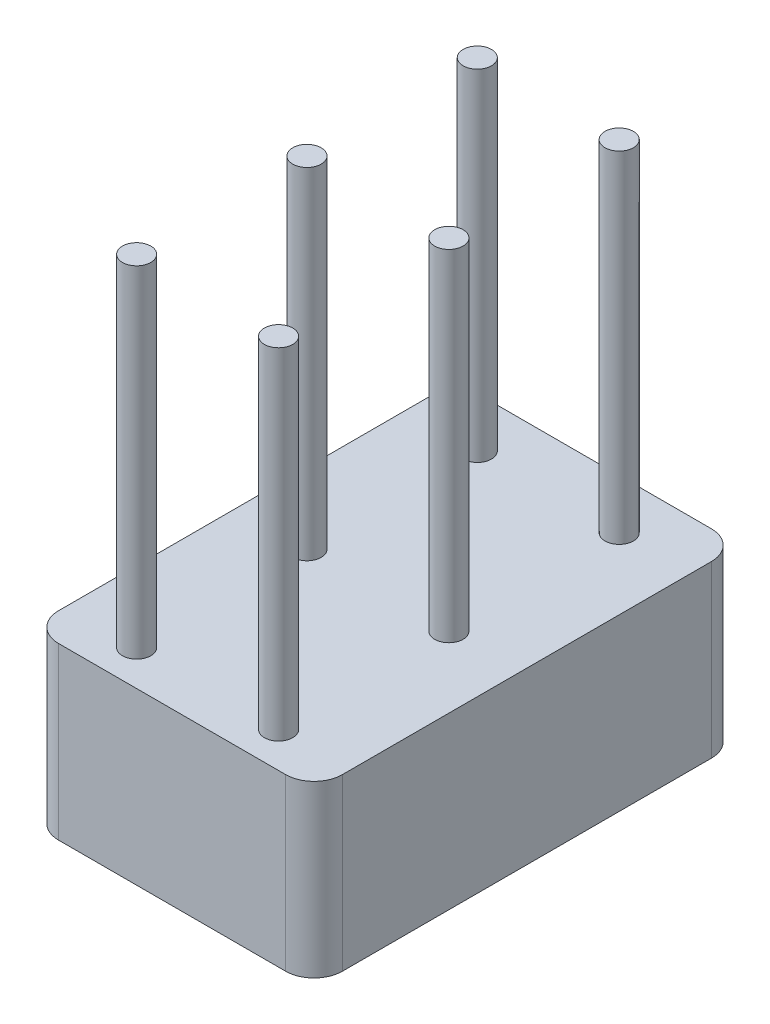
ISO-10303-21;
HEADER;
FILE_DESCRIPTION(('STEP AP214'),'2;1');
FILE_NAME('part.step','',(''),(''),'','','');
FILE_SCHEMA(('AUTOMOTIVE_DESIGN { 1 0 10303 214 1 1 1 1 }'));
ENDSEC;
DATA;
#1=APPLICATION_CONTEXT('core data for automotive mechanical design processes');
#2=APPLICATION_PROTOCOL_DEFINITION('international standard','automotive_design',2000,#1);
#3=PRODUCT_CONTEXT('',#1,'mechanical');
#4=PRODUCT('Part','Part','',(#3));
#5=PRODUCT_RELATED_PRODUCT_CATEGORY('part','',(#4));
#6=PRODUCT_DEFINITION_FORMATION('','',#4);
#7=PRODUCT_DEFINITION_CONTEXT('part definition',#1,'design');
#8=PRODUCT_DEFINITION('design','',#6,#7);
#9=PRODUCT_DEFINITION_SHAPE('','',#8);
#10=(LENGTH_UNIT() NAMED_UNIT(*) SI_UNIT(.MILLI.,.METRE.));
#11=(NAMED_UNIT(*) PLANE_ANGLE_UNIT() SI_UNIT($,.RADIAN.));
#12=(NAMED_UNIT(*) SI_UNIT($,.STERADIAN.) SOLID_ANGLE_UNIT());
#13=UNCERTAINTY_MEASURE_WITH_UNIT(LENGTH_MEASURE(1.E-05),#10,'distance_accuracy_value','');
#14=(GEOMETRIC_REPRESENTATION_CONTEXT(3) GLOBAL_UNCERTAINTY_ASSIGNED_CONTEXT((#13)) GLOBAL_UNIT_ASSIGNED_CONTEXT((#10,
#11,#12)) REPRESENTATION_CONTEXT('',''));
#15=CARTESIAN_POINT('',(0.,0.,0.));
#16=DIRECTION('',(0.,0.,1.));
#17=DIRECTION('',(1.,0.,0.));
#18=AXIS2_PLACEMENT_3D('',#15,#16,#17);
#19=CARTESIAN_POINT('',(2.,3.,-3.25));
#20=DIRECTION('',(0.,1.,0.));
#21=DIRECTION('',(0.,0.,1.));
#22=AXIS2_PLACEMENT_3D('',#19,#20,#21);
#23=PLANE('',#22);
#24=CARTESIAN_POINT('',(-1.24999999999994,3.,3.12455171858));
#25=DIRECTION('',(0.,1.,0.));
#26=DIRECTION('',(0.,0.,1.));
#27=AXIS2_PLACEMENT_3D('',#24,#25,#26);
#28=CIRCLE('',#27,0.25);
#29=CARTESIAN_POINT('',(-1.24999999999994,3.,3.37455171858));
#30=VERTEX_POINT('',#29);
#31=EDGE_CURVE('E204',#30,#30,#28,.T.);
#32=ORIENTED_EDGE('',*,*,#31,.F.);
#33=EDGE_LOOP('',(#32));
#34=FACE_BOUND('',#33,.T.);
#35=CARTESIAN_POINT('',(-1.24999999999997,3.,0.124551718579996));
#36=DIRECTION('',(0.,1.,0.));
#37=DIRECTION('',(0.,0.,1.));
#38=AXIS2_PLACEMENT_3D('',#35,#36,#37);
#39=CIRCLE('',#38,0.25);
#40=CARTESIAN_POINT('',(-1.24999999999997,3.,0.374551718579996));
#41=VERTEX_POINT('',#40);
#42=EDGE_CURVE('E192',#41,#41,#39,.T.);
#43=ORIENTED_EDGE('',*,*,#42,.F.);
#44=EDGE_LOOP('',(#43));
#45=FACE_BOUND('',#44,.T.);
#46=CARTESIAN_POINT('',(-1.25,3.,-2.87544828142));
#47=DIRECTION('',(0.,1.,0.));
#48=DIRECTION('',(0.,0.,1.));
#49=AXIS2_PLACEMENT_3D('',#46,#47,#48);
#50=CIRCLE('',#49,0.25);
#51=CARTESIAN_POINT('',(-1.25,3.,-2.62544828142));
#52=VERTEX_POINT('',#51);
#53=EDGE_CURVE('E180',#52,#52,#50,.T.);
#54=ORIENTED_EDGE('',*,*,#53,.F.);
#55=EDGE_LOOP('',(#54));
#56=FACE_BOUND('',#55,.T.);
#57=CARTESIAN_POINT('',(2.,3.,-3.25));
#58=DIRECTION('',(0.,1.,0.));
#59=DIRECTION('',(0.,0.,1.));
#60=AXIS2_PLACEMENT_3D('',#57,#58,#59);
#61=CIRCLE('',#60,0.5);
#62=CARTESIAN_POINT('',(2.5,3.,-3.25));
#63=VERTEX_POINT('',#62);
#64=CARTESIAN_POINT('',(2.,3.,-3.75));
#65=VERTEX_POINT('',#64);
#66=EDGE_CURVE('E147',#63,#65,#61,.T.);
#67=ORIENTED_EDGE('',*,*,#66,.T.);
#68=DIRECTION('',(-1.,0.,0.));
#69=VECTOR('',#68,1.);
#70=CARTESIAN_POINT('',(-2.,3.,-3.75));
#71=LINE('',#70,#69);
#72=CARTESIAN_POINT('',(-2.,3.,-3.75));
#73=VERTEX_POINT('',#72);
#74=EDGE_CURVE('E95',#65,#73,#71,.T.);
#75=ORIENTED_EDGE('',*,*,#74,.T.);
#76=CARTESIAN_POINT('',(-2.,3.,-3.25));
#77=DIRECTION('',(0.,1.,0.));
#78=DIRECTION('',(0.,0.,1.));
#79=AXIS2_PLACEMENT_3D('',#76,#77,#78);
#80=CIRCLE('',#79,0.5);
#81=CARTESIAN_POINT('',(-2.5,3.,-3.25));
#82=VERTEX_POINT('',#81);
#83=EDGE_CURVE('E162',#73,#82,#80,.T.);
#84=ORIENTED_EDGE('',*,*,#83,.T.);
#85=DIRECTION('',(0.,0.,1.));
#86=VECTOR('',#85,1.);
#87=CARTESIAN_POINT('',(-2.5,3.,-3.25));
#88=LINE('',#87,#86);
#89=CARTESIAN_POINT('',(-2.5,3.,3.25));
#90=VERTEX_POINT('',#89);
#91=EDGE_CURVE('E174',#82,#90,#88,.T.);
#92=ORIENTED_EDGE('',*,*,#91,.T.);
#93=CARTESIAN_POINT('',(-2.,3.,3.25));
#94=DIRECTION('',(0.,1.,0.));
#95=DIRECTION('',(0.,0.,-1.));
#96=AXIS2_PLACEMENT_3D('',#93,#94,#95);
#97=CIRCLE('',#96,0.5);
#98=CARTESIAN_POINT('',(-2.,3.,3.75));
#99=VERTEX_POINT('',#98);
#100=EDGE_CURVE('E114',#90,#99,#97,.T.);
#101=ORIENTED_EDGE('',*,*,#100,.T.);
#102=DIRECTION('',(1.,0.,0.));
#103=VECTOR('',#102,1.);
#104=CARTESIAN_POINT('',(-2.,3.,3.75));
#105=LINE('',#104,#103);
#106=CARTESIAN_POINT('',(2.,3.,3.75));
#107=VERTEX_POINT('',#106);
#108=EDGE_CURVE('E108',#99,#107,#105,.T.);
#109=ORIENTED_EDGE('',*,*,#108,.T.);
#110=CARTESIAN_POINT('',(2.,3.,3.25));
#111=DIRECTION('',(0.,1.,0.));
#112=DIRECTION('',(0.,0.,-1.));
#113=AXIS2_PLACEMENT_3D('',#110,#111,#112);
#114=CIRCLE('',#113,0.5);
#115=CARTESIAN_POINT('',(2.5,3.,3.25));
#116=VERTEX_POINT('',#115);
#117=EDGE_CURVE('E112',#107,#116,#114,.T.);
#118=ORIENTED_EDGE('',*,*,#117,.T.);
#119=DIRECTION('',(0.,0.,-1.));
#120=VECTOR('',#119,1.);
#121=CARTESIAN_POINT('',(2.5,3.,-3.25));
#122=LINE('',#121,#120);
#123=EDGE_CURVE('E52',#116,#63,#122,.T.);
#124=ORIENTED_EDGE('',*,*,#123,.T.);
#125=EDGE_LOOP('',(#67,#75,#84,#92,#101,#109,#118,#124));
#126=FACE_BOUND('',#125,.T.);
#127=CARTESIAN_POINT('',(1.25,3.,-2.87544828142));
#128=DIRECTION('',(0.,1.,0.));
#129=DIRECTION('',(0.,0.,-1.));
#130=AXIS2_PLACEMENT_3D('',#127,#128,#129);
#131=CIRCLE('',#130,0.25);
#132=CARTESIAN_POINT('',(1.25,3.,-3.12544828142));
#133=VERTEX_POINT('',#132);
#134=EDGE_CURVE('E186',#133,#133,#131,.T.);
#135=ORIENTED_EDGE('',*,*,#134,.F.);
#136=EDGE_LOOP('',(#135));
#137=FACE_BOUND('',#136,.T.);
#138=CARTESIAN_POINT('',(1.25000000000003,3.,0.124551718579996));
#139=DIRECTION('',(0.,1.,0.));
#140=DIRECTION('',(0.,0.,-1.));
#141=AXIS2_PLACEMENT_3D('',#138,#139,#140);
#142=CIRCLE('',#141,0.25);
#143=CARTESIAN_POINT('',(1.25000000000003,3.,-0.125448281420004));
#144=VERTEX_POINT('',#143);
#145=EDGE_CURVE('E198',#144,#144,#142,.T.);
#146=ORIENTED_EDGE('',*,*,#145,.F.);
#147=EDGE_LOOP('',(#146));
#148=FACE_BOUND('',#147,.T.);
#149=CARTESIAN_POINT('',(1.25000000000006,3.,3.12455171858));
#150=DIRECTION('',(0.,1.,0.));
#151=DIRECTION('',(0.,0.,-1.));
#152=AXIS2_PLACEMENT_3D('',#149,#150,#151);
#153=CIRCLE('',#152,0.25);
#154=CARTESIAN_POINT('',(1.25000000000006,3.,2.87455171858));
#155=VERTEX_POINT('',#154);
#156=EDGE_CURVE('E210',#155,#155,#153,.T.);
#157=ORIENTED_EDGE('',*,*,#156,.F.);
#158=EDGE_LOOP('',(#157));
#159=FACE_BOUND('',#158,.T.);
#160=ADVANCED_FACE('F35',(#34,#45,#56,#126,#137,#148,#159),#23,.T.);
#161=CARTESIAN_POINT('',(2.,3.,-3.25));
#162=DIRECTION('',(0.,-1.,0.));
#163=DIRECTION('',(0.,0.,-1.));
#164=AXIS2_PLACEMENT_3D('',#161,#162,#163);
#165=CYLINDRICAL_SURFACE('',#164,0.5);
#166=CARTESIAN_POINT('',(2.,0.,-3.25));
#167=DIRECTION('',(0.,1.,0.));
#168=DIRECTION('',(0.,0.,1.));
#169=AXIS2_PLACEMENT_3D('',#166,#167,#168);
#170=CIRCLE('',#169,0.5);
#171=CARTESIAN_POINT('',(2.5,0.,-3.25));
#172=VERTEX_POINT('',#171);
#173=CARTESIAN_POINT('',(2.,0.,-3.75));
#174=VERTEX_POINT('',#173);
#175=EDGE_CURVE('E132',#172,#174,#170,.T.);
#176=ORIENTED_EDGE('',*,*,#175,.T.);
#177=DIRECTION('',(0.,-1.,0.));
#178=VECTOR('',#177,1.);
#179=CARTESIAN_POINT('',(2.,3.,-3.75));
#180=LINE('',#179,#178);
#181=EDGE_CURVE('E11',#65,#174,#180,.T.);
#182=ORIENTED_EDGE('',*,*,#181,.F.);
#183=ORIENTED_EDGE('',*,*,#66,.F.);
#184=DIRECTION('',(0.,-1.,0.));
#185=VECTOR('',#184,1.);
#186=CARTESIAN_POINT('',(2.5,3.,-3.25));
#187=LINE('',#186,#185);
#188=EDGE_CURVE('E128',#63,#172,#187,.T.);
#189=ORIENTED_EDGE('',*,*,#188,.T.);
#190=EDGE_LOOP('',(#176,#182,#183,#189));
#191=FACE_BOUND('',#190,.T.);
#192=ADVANCED_FACE('F37',(#191),#165,.T.);
#193=CARTESIAN_POINT('',(-2.,3.,-3.75));
#194=DIRECTION('',(0.,0.,1.));
#195=DIRECTION('',(1.,0.,0.));
#196=AXIS2_PLACEMENT_3D('',#193,#194,#195);
#197=PLANE('',#196);
#198=DIRECTION('',(-1.,0.,0.));
#199=VECTOR('',#198,1.);
#200=CARTESIAN_POINT('',(-2.,0.,-3.75));
#201=LINE('',#200,#199);
#202=CARTESIAN_POINT('',(-2.,0.,-3.75));
#203=VERTEX_POINT('',#202);
#204=EDGE_CURVE('E135',#174,#203,#201,.T.);
#205=ORIENTED_EDGE('',*,*,#204,.T.);
#206=DIRECTION('',(0.,-1.,0.));
#207=VECTOR('',#206,1.);
#208=CARTESIAN_POINT('',(-2.,3.,-3.75));
#209=LINE('',#208,#207);
#210=EDGE_CURVE('E44',#73,#203,#209,.T.);
#211=ORIENTED_EDGE('',*,*,#210,.F.);
#212=ORIENTED_EDGE('',*,*,#74,.F.);
#213=ORIENTED_EDGE('',*,*,#181,.T.);
#214=EDGE_LOOP('',(#205,#211,#212,#213));
#215=FACE_BOUND('',#214,.T.);
#216=ADVANCED_FACE('F231',(#215),#197,.F.);
#217=CARTESIAN_POINT('',(-2.,3.,-3.25));
#218=DIRECTION('',(0.,-1.,0.));
#219=DIRECTION('',(0.,0.,-1.));
#220=AXIS2_PLACEMENT_3D('',#217,#218,#219);
#221=CYLINDRICAL_SURFACE('',#220,0.5);
#222=CARTESIAN_POINT('',(-2.,0.,-3.25));
#223=DIRECTION('',(0.,1.,0.));
#224=DIRECTION('',(0.,0.,1.));
#225=AXIS2_PLACEMENT_3D('',#222,#223,#224);
#226=CIRCLE('',#225,0.5);
#227=CARTESIAN_POINT('',(-2.5,0.,-3.25));
#228=VERTEX_POINT('',#227);
#229=EDGE_CURVE('E138',#203,#228,#226,.T.);
#230=ORIENTED_EDGE('',*,*,#229,.T.);
#231=DIRECTION('',(0.,-1.,0.));
#232=VECTOR('',#231,1.);
#233=CARTESIAN_POINT('',(-2.5,3.,-3.25));
#234=LINE('',#233,#232);
#235=EDGE_CURVE('E154',#82,#228,#234,.T.);
#236=ORIENTED_EDGE('',*,*,#235,.F.);
#237=ORIENTED_EDGE('',*,*,#83,.F.);
#238=ORIENTED_EDGE('',*,*,#210,.T.);
#239=EDGE_LOOP('',(#230,#236,#237,#238));
#240=FACE_BOUND('',#239,.T.);
#241=ADVANCED_FACE('F160',(#240),#221,.T.);
#242=CARTESIAN_POINT('',(-2.5,3.,-3.25));
#243=DIRECTION('',(1.,0.,0.));
#244=DIRECTION('',(0.,0.,-1.));
#245=AXIS2_PLACEMENT_3D('',#242,#243,#244);
#246=PLANE('',#245);
#247=DIRECTION('',(0.,0.,1.));
#248=VECTOR('',#247,1.);
#249=CARTESIAN_POINT('',(-2.5,0.,-3.25));
#250=LINE('',#249,#248);
#251=CARTESIAN_POINT('',(-2.5,0.,3.25));
#252=VERTEX_POINT('',#251);
#253=EDGE_CURVE('E140',#228,#252,#250,.T.);
#254=ORIENTED_EDGE('',*,*,#253,.T.);
#255=DIRECTION('',(0.,-1.,0.));
#256=VECTOR('',#255,1.);
#257=CARTESIAN_POINT('',(-2.5,3.,3.25));
#258=LINE('',#257,#256);
#259=EDGE_CURVE('E151',#90,#252,#258,.T.);
#260=ORIENTED_EDGE('',*,*,#259,.F.);
#261=ORIENTED_EDGE('',*,*,#91,.F.);
#262=ORIENTED_EDGE('',*,*,#235,.T.);
#263=EDGE_LOOP('',(#254,#260,#261,#262));
#264=FACE_BOUND('',#263,.T.);
#265=ADVANCED_FACE('F170',(#264),#246,.F.);
#266=CARTESIAN_POINT('',(-2.,3.,3.25));
#267=DIRECTION('',(0.,-1.,0.));
#268=DIRECTION('',(0.,0.,-1.));
#269=AXIS2_PLACEMENT_3D('',#266,#267,#268);
#270=CYLINDRICAL_SURFACE('',#269,0.5);
#271=CARTESIAN_POINT('',(-2.,0.,3.25));
#272=DIRECTION('',(0.,1.,0.));
#273=DIRECTION('',(0.,0.,-1.));
#274=AXIS2_PLACEMENT_3D('',#271,#272,#273);
#275=CIRCLE('',#274,0.5);
#276=CARTESIAN_POINT('',(-2.,0.,3.75));
#277=VERTEX_POINT('',#276);
#278=EDGE_CURVE('E142',#252,#277,#275,.T.);
#279=ORIENTED_EDGE('',*,*,#278,.T.);
#280=DIRECTION('',(0.,-1.,0.));
#281=VECTOR('',#280,1.);
#282=CARTESIAN_POINT('',(-2.,3.,3.75));
#283=LINE('',#282,#281);
#284=EDGE_CURVE('E123',#99,#277,#283,.T.);
#285=ORIENTED_EDGE('',*,*,#284,.F.);
#286=ORIENTED_EDGE('',*,*,#100,.F.);
#287=ORIENTED_EDGE('',*,*,#259,.T.);
#288=EDGE_LOOP('',(#279,#285,#286,#287));
#289=FACE_BOUND('',#288,.T.);
#290=ADVANCED_FACE('F173',(#289),#270,.T.);
#291=CARTESIAN_POINT('',(-2.,3.,3.75));
#292=DIRECTION('',(0.,0.,-1.));
#293=DIRECTION('',(-1.,0.,0.));
#294=AXIS2_PLACEMENT_3D('',#291,#292,#293);
#295=PLANE('',#294);
#296=DIRECTION('',(1.,0.,0.));
#297=VECTOR('',#296,1.);
#298=CARTESIAN_POINT('',(-2.,0.,3.75));
#299=LINE('',#298,#297);
#300=CARTESIAN_POINT('',(2.,0.,3.75));
#301=VERTEX_POINT('',#300);
#302=EDGE_CURVE('E122',#277,#301,#299,.T.);
#303=ORIENTED_EDGE('',*,*,#302,.T.);
#304=DIRECTION('',(0.,-1.,0.));
#305=VECTOR('',#304,1.);
#306=CARTESIAN_POINT('',(2.,3.,3.75));
#307=LINE('',#306,#305);
#308=EDGE_CURVE('E119',#107,#301,#307,.T.);
#309=ORIENTED_EDGE('',*,*,#308,.F.);
#310=ORIENTED_EDGE('',*,*,#108,.F.);
#311=ORIENTED_EDGE('',*,*,#284,.T.);
#312=EDGE_LOOP('',(#303,#309,#310,#311));
#313=FACE_BOUND('',#312,.T.);
#314=ADVANCED_FACE('F120',(#313),#295,.F.);
#315=CARTESIAN_POINT('',(2.,3.,3.25));
#316=DIRECTION('',(0.,-1.,0.));
#317=DIRECTION('',(0.,0.,-1.));
#318=AXIS2_PLACEMENT_3D('',#315,#316,#317);
#319=CYLINDRICAL_SURFACE('',#318,0.5);
#320=CARTESIAN_POINT('',(2.,0.,3.25));
#321=DIRECTION('',(0.,1.,0.));
#322=DIRECTION('',(0.,0.,-1.));
#323=AXIS2_PLACEMENT_3D('',#320,#321,#322);
#324=CIRCLE('',#323,0.5);
#325=CARTESIAN_POINT('',(2.5,0.,3.25));
#326=VERTEX_POINT('',#325);
#327=EDGE_CURVE('E81',#301,#326,#324,.T.);
#328=ORIENTED_EDGE('',*,*,#327,.T.);
#329=DIRECTION('',(0.,-1.,0.));
#330=VECTOR('',#329,1.);
#331=CARTESIAN_POINT('',(2.5,3.,3.25));
#332=LINE('',#331,#330);
#333=EDGE_CURVE('E124',#116,#326,#332,.T.);
#334=ORIENTED_EDGE('',*,*,#333,.F.);
#335=ORIENTED_EDGE('',*,*,#117,.F.);
#336=ORIENTED_EDGE('',*,*,#308,.T.);
#337=EDGE_LOOP('',(#328,#334,#335,#336));
#338=FACE_BOUND('',#337,.T.);
#339=ADVANCED_FACE('F126',(#338),#319,.T.);
#340=CARTESIAN_POINT('',(2.5,3.,-3.25));
#341=DIRECTION('',(-1.,0.,0.));
#342=DIRECTION('',(0.,0.,1.));
#343=AXIS2_PLACEMENT_3D('',#340,#341,#342);
#344=PLANE('',#343);
#345=DIRECTION('',(0.,0.,-1.));
#346=VECTOR('',#345,1.);
#347=CARTESIAN_POINT('',(2.5,0.,-3.25));
#348=LINE('',#347,#346);
#349=EDGE_CURVE('E87',#326,#172,#348,.T.);
#350=ORIENTED_EDGE('',*,*,#349,.T.);
#351=ORIENTED_EDGE('',*,*,#188,.F.);
#352=ORIENTED_EDGE('',*,*,#123,.F.);
#353=ORIENTED_EDGE('',*,*,#333,.T.);
#354=EDGE_LOOP('',(#350,#351,#352,#353));
#355=FACE_BOUND('',#354,.T.);
#356=ADVANCED_FACE('F241',(#355),#344,.F.);
#357=CARTESIAN_POINT('',(2.,0.,-3.25));
#358=DIRECTION('',(0.,1.,0.));
#359=DIRECTION('',(0.,0.,1.));
#360=AXIS2_PLACEMENT_3D('',#357,#358,#359);
#361=PLANE('',#360);
#362=ORIENTED_EDGE('',*,*,#175,.F.);
#363=ORIENTED_EDGE('',*,*,#349,.F.);
#364=ORIENTED_EDGE('',*,*,#327,.F.);
#365=ORIENTED_EDGE('',*,*,#302,.F.);
#366=ORIENTED_EDGE('',*,*,#278,.F.);
#367=ORIENTED_EDGE('',*,*,#253,.F.);
#368=ORIENTED_EDGE('',*,*,#229,.F.);
#369=ORIENTED_EDGE('',*,*,#204,.F.);
#370=EDGE_LOOP('',(#362,#363,#364,#365,#366,#367,#368,#369));
#371=FACE_BOUND('',#370,.T.);
#372=ADVANCED_FACE('F166',(#371),#361,.F.);
#373=CARTESIAN_POINT('',(-1.25,9.,-2.87544828142));
#374=DIRECTION('',(0.,-1.,0.));
#375=DIRECTION('',(0.,0.,-1.));
#376=AXIS2_PLACEMENT_3D('',#373,#374,#375);
#377=CYLINDRICAL_SURFACE('',#376,0.25);
#378=CARTESIAN_POINT('',(-1.25,9.,-2.87544828142));
#379=DIRECTION('',(0.,1.,0.));
#380=DIRECTION('',(0.,0.,1.));
#381=AXIS2_PLACEMENT_3D('',#378,#379,#380);
#382=CIRCLE('',#381,0.25);
#383=CARTESIAN_POINT('',(-1.25,9.,-2.62544828142));
#384=VERTEX_POINT('',#383);
#385=EDGE_CURVE('E136',#384,#384,#382,.T.);
#386=ORIENTED_EDGE('',*,*,#385,.F.);
#387=EDGE_LOOP('',(#386));
#388=FACE_BOUND('',#387,.T.);
#389=ORIENTED_EDGE('',*,*,#53,.T.);
#390=EDGE_LOOP('',(#389));
#391=FACE_BOUND('',#390,.T.);
#392=ADVANCED_FACE('F237',(#388,#391),#377,.T.);
#393=CARTESIAN_POINT('',(-1.25,9.,-2.87544828142));
#394=DIRECTION('',(0.,1.,0.));
#395=DIRECTION('',(0.,0.,1.));
#396=AXIS2_PLACEMENT_3D('',#393,#394,#395);
#397=PLANE('',#396);
#398=ORIENTED_EDGE('',*,*,#385,.T.);
#399=EDGE_LOOP('',(#398));
#400=FACE_BOUND('',#399,.T.);
#401=ADVANCED_FACE('F294',(#400),#397,.T.);
#402=CARTESIAN_POINT('',(1.25,9.,-2.87544828142));
#403=DIRECTION('',(0.,-1.,0.));
#404=DIRECTION('',(0.,0.,-1.));
#405=AXIS2_PLACEMENT_3D('',#402,#403,#404);
#406=CYLINDRICAL_SURFACE('',#405,0.25);
#407=CARTESIAN_POINT('',(1.25,9.,-2.87544828142));
#408=DIRECTION('',(0.,1.,0.));
#409=DIRECTION('',(0.,0.,-1.));
#410=AXIS2_PLACEMENT_3D('',#407,#408,#409);
#411=CIRCLE('',#410,0.25);
#412=CARTESIAN_POINT('',(1.25,9.,-3.12544828142));
#413=VERTEX_POINT('',#412);
#414=EDGE_CURVE('E183',#413,#413,#411,.T.);
#415=ORIENTED_EDGE('',*,*,#414,.F.);
#416=EDGE_LOOP('',(#415));
#417=FACE_BOUND('',#416,.T.);
#418=ORIENTED_EDGE('',*,*,#134,.T.);
#419=EDGE_LOOP('',(#418));
#420=FACE_BOUND('',#419,.T.);
#421=ADVANCED_FACE('F301',(#417,#420),#406,.T.);
#422=CARTESIAN_POINT('',(1.25,9.,-2.87544828142));
#423=DIRECTION('',(0.,-1.,0.));
#424=DIRECTION('',(0.,0.,-1.));
#425=AXIS2_PLACEMENT_3D('',#422,#423,#424);
#426=PLANE('',#425);
#427=ORIENTED_EDGE('',*,*,#414,.T.);
#428=EDGE_LOOP('',(#427));
#429=FACE_BOUND('',#428,.T.);
#430=ADVANCED_FACE('F308',(#429),#426,.F.);
#431=CARTESIAN_POINT('',(-1.24999999999997,9.,0.124551718579996));
#432=DIRECTION('',(0.,-1.,0.));
#433=DIRECTION('',(0.,0.,-1.));
#434=AXIS2_PLACEMENT_3D('',#431,#432,#433);
#435=CYLINDRICAL_SURFACE('',#434,0.25);
#436=CARTESIAN_POINT('',(-1.24999999999997,9.,0.124551718579996));
#437=DIRECTION('',(0.,1.,0.));
#438=DIRECTION('',(0.,0.,1.));
#439=AXIS2_PLACEMENT_3D('',#436,#437,#438);
#440=CIRCLE('',#439,0.25);
#441=CARTESIAN_POINT('',(-1.24999999999997,9.,0.374551718579996));
#442=VERTEX_POINT('',#441);
#443=EDGE_CURVE('E189',#442,#442,#440,.T.);
#444=ORIENTED_EDGE('',*,*,#443,.F.);
#445=EDGE_LOOP('',(#444));
#446=FACE_BOUND('',#445,.T.);
#447=ORIENTED_EDGE('',*,*,#42,.T.);
#448=EDGE_LOOP('',(#447));
#449=FACE_BOUND('',#448,.T.);
#450=ADVANCED_FACE('F316',(#446,#449),#435,.T.);
#451=CARTESIAN_POINT('',(-1.24999999999997,9.,0.124551718579996));
#452=DIRECTION('',(0.,1.,0.));
#453=DIRECTION('',(0.,0.,1.));
#454=AXIS2_PLACEMENT_3D('',#451,#452,#453);
#455=PLANE('',#454);
#456=ORIENTED_EDGE('',*,*,#443,.T.);
#457=EDGE_LOOP('',(#456));
#458=FACE_BOUND('',#457,.T.);
#459=ADVANCED_FACE('F324',(#458),#455,.T.);
#460=CARTESIAN_POINT('',(1.25000000000003,9.,0.124551718579996));
#461=DIRECTION('',(0.,-1.,0.));
#462=DIRECTION('',(0.,0.,-1.));
#463=AXIS2_PLACEMENT_3D('',#460,#461,#462);
#464=CYLINDRICAL_SURFACE('',#463,0.25);
#465=CARTESIAN_POINT('',(1.25000000000003,9.,0.124551718579996));
#466=DIRECTION('',(0.,1.,0.));
#467=DIRECTION('',(0.,0.,-1.));
#468=AXIS2_PLACEMENT_3D('',#465,#466,#467);
#469=CIRCLE('',#468,0.25);
#470=CARTESIAN_POINT('',(1.25000000000003,9.,-0.125448281420004));
#471=VERTEX_POINT('',#470);
#472=EDGE_CURVE('E195',#471,#471,#469,.T.);
#473=ORIENTED_EDGE('',*,*,#472,.F.);
#474=EDGE_LOOP('',(#473));
#475=FACE_BOUND('',#474,.T.);
#476=ORIENTED_EDGE('',*,*,#145,.T.);
#477=EDGE_LOOP('',(#476));
#478=FACE_BOUND('',#477,.T.);
#479=ADVANCED_FACE('F332',(#475,#478),#464,.T.);
#480=CARTESIAN_POINT('',(1.25000000000003,9.,0.124551718579996));
#481=DIRECTION('',(0.,-1.,0.));
#482=DIRECTION('',(0.,0.,-1.));
#483=AXIS2_PLACEMENT_3D('',#480,#481,#482);
#484=PLANE('',#483);
#485=ORIENTED_EDGE('',*,*,#472,.T.);
#486=EDGE_LOOP('',(#485));
#487=FACE_BOUND('',#486,.T.);
#488=ADVANCED_FACE('F340',(#487),#484,.F.);
#489=CARTESIAN_POINT('',(-1.24999999999994,9.,3.12455171858));
#490=DIRECTION('',(0.,-1.,0.));
#491=DIRECTION('',(0.,0.,-1.));
#492=AXIS2_PLACEMENT_3D('',#489,#490,#491);
#493=CYLINDRICAL_SURFACE('',#492,0.25);
#494=CARTESIAN_POINT('',(-1.24999999999994,9.,3.12455171858));
#495=DIRECTION('',(0.,1.,0.));
#496=DIRECTION('',(0.,0.,1.));
#497=AXIS2_PLACEMENT_3D('',#494,#495,#496);
#498=CIRCLE('',#497,0.25);
#499=CARTESIAN_POINT('',(-1.24999999999994,9.,3.37455171858));
#500=VERTEX_POINT('',#499);
#501=EDGE_CURVE('E201',#500,#500,#498,.T.);
#502=ORIENTED_EDGE('',*,*,#501,.F.);
#503=EDGE_LOOP('',(#502));
#504=FACE_BOUND('',#503,.T.);
#505=ORIENTED_EDGE('',*,*,#31,.T.);
#506=EDGE_LOOP('',(#505));
#507=FACE_BOUND('',#506,.T.);
#508=ADVANCED_FACE('F348',(#504,#507),#493,.T.);
#509=CARTESIAN_POINT('',(-1.24999999999994,9.,3.12455171858));
#510=DIRECTION('',(0.,1.,0.));
#511=DIRECTION('',(0.,0.,1.));
#512=AXIS2_PLACEMENT_3D('',#509,#510,#511);
#513=PLANE('',#512);
#514=ORIENTED_EDGE('',*,*,#501,.T.);
#515=EDGE_LOOP('',(#514));
#516=FACE_BOUND('',#515,.T.);
#517=ADVANCED_FACE('F221',(#516),#513,.T.);
#518=CARTESIAN_POINT('',(1.25000000000006,9.,3.12455171858));
#519=DIRECTION('',(0.,-1.,0.));
#520=DIRECTION('',(0.,0.,-1.));
#521=AXIS2_PLACEMENT_3D('',#518,#519,#520);
#522=CYLINDRICAL_SURFACE('',#521,0.25);
#523=CARTESIAN_POINT('',(1.25000000000006,9.,3.12455171858));
#524=DIRECTION('',(0.,1.,0.));
#525=DIRECTION('',(0.,0.,-1.));
#526=AXIS2_PLACEMENT_3D('',#523,#524,#525);
#527=CIRCLE('',#526,0.25);
#528=CARTESIAN_POINT('',(1.25000000000006,9.,2.87455171858));
#529=VERTEX_POINT('',#528);
#530=EDGE_CURVE('E207',#529,#529,#527,.T.);
#531=ORIENTED_EDGE('',*,*,#530,.F.);
#532=EDGE_LOOP('',(#531));
#533=FACE_BOUND('',#532,.T.);
#534=ORIENTED_EDGE('',*,*,#156,.T.);
#535=EDGE_LOOP('',(#534));
#536=FACE_BOUND('',#535,.T.);
#537=ADVANCED_FACE('F218',(#533,#536),#522,.T.);
#538=CARTESIAN_POINT('',(1.25000000000006,9.,3.12455171858));
#539=DIRECTION('',(0.,-1.,0.));
#540=DIRECTION('',(0.,0.,-1.));
#541=AXIS2_PLACEMENT_3D('',#538,#539,#540);
#542=PLANE('',#541);
#543=ORIENTED_EDGE('',*,*,#530,.T.);
#544=EDGE_LOOP('',(#543));
#545=FACE_BOUND('',#544,.T.);
#546=ADVANCED_FACE('F216',(#545),#542,.F.);
#547=CLOSED_SHELL('',(#160,#192,#216,#241,#265,#290,#314,#339,#356,#372,#392,#401,#421,#430,
#450,#459,#479,#488,#508,#517,#537,#546));
#548=MANIFOLD_SOLID_BREP('B2',#547);
#549=ADVANCED_BREP_SHAPE_REPRESENTATION('',(#18,#548),#14);
#550=SHAPE_DEFINITION_REPRESENTATION(#9,#549);
ENDSEC;
END-ISO-10303-21;
